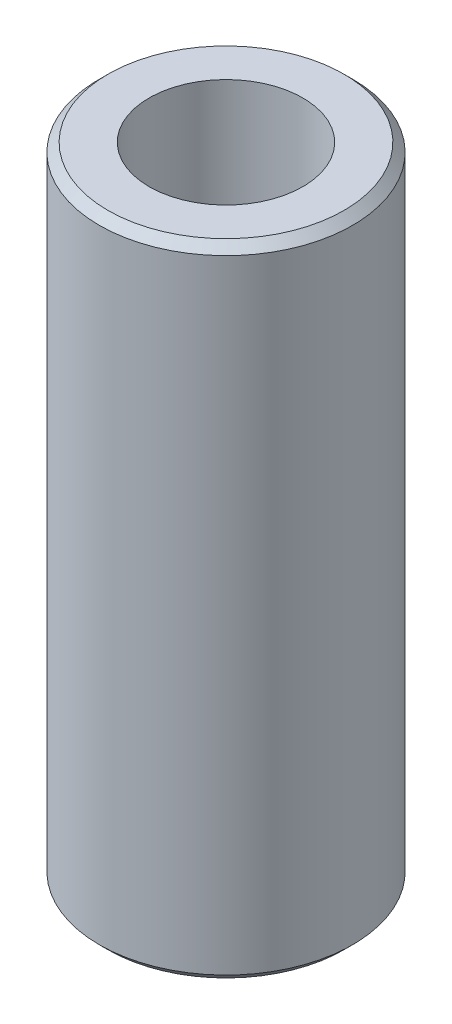
ISO-10303-21;
HEADER;
FILE_DESCRIPTION(('STEP AP214'),'2;1');
FILE_NAME('part.step','',(''),(''),'','','');
FILE_SCHEMA(('AUTOMOTIVE_DESIGN { 1 0 10303 214 1 1 1 1 }'));
ENDSEC;
DATA;
#1=APPLICATION_CONTEXT('core data for automotive mechanical design processes');
#2=APPLICATION_PROTOCOL_DEFINITION('international standard','automotive_design',2000,#1);
#3=PRODUCT_CONTEXT('',#1,'mechanical');
#4=PRODUCT('Part','Part','',(#3));
#5=PRODUCT_RELATED_PRODUCT_CATEGORY('part','',(#4));
#6=PRODUCT_DEFINITION_FORMATION('','',#4);
#7=PRODUCT_DEFINITION_CONTEXT('part definition',#1,'design');
#8=PRODUCT_DEFINITION('design','',#6,#7);
#9=PRODUCT_DEFINITION_SHAPE('','',#8);
#10=(LENGTH_UNIT() NAMED_UNIT(*) SI_UNIT(.MILLI.,.METRE.));
#11=(NAMED_UNIT(*) PLANE_ANGLE_UNIT() SI_UNIT($,.RADIAN.));
#12=(NAMED_UNIT(*) SI_UNIT($,.STERADIAN.) SOLID_ANGLE_UNIT());
#13=UNCERTAINTY_MEASURE_WITH_UNIT(LENGTH_MEASURE(1.E-05),#10,'distance_accuracy_value','');
#14=(GEOMETRIC_REPRESENTATION_CONTEXT(3) GLOBAL_UNCERTAINTY_ASSIGNED_CONTEXT((#13)) GLOBAL_UNIT_ASSIGNED_CONTEXT((#10,
#11,#12)) REPRESENTATION_CONTEXT('',''));
#15=CARTESIAN_POINT('',(0.,0.,0.));
#16=DIRECTION('',(0.,0.,1.));
#17=DIRECTION('',(1.,0.,0.));
#18=AXIS2_PLACEMENT_3D('',#15,#16,#17);
#19=CARTESIAN_POINT('',(0.,290.682610444791,0.));
#20=DIRECTION('',(0.,-1.,0.));
#21=DIRECTION('',(0.,0.,-1.));
#22=AXIS2_PLACEMENT_3D('',#19,#20,#21);
#23=CYLINDRICAL_SURFACE('',#22,57.5);
#24=CARTESIAN_POINT('',(0.,286.769581008649,0.));
#25=DIRECTION('',(0.,1.,0.));
#26=DIRECTION('',(0.,0.,1.));
#27=AXIS2_PLACEMENT_3D('',#24,#25,#26);
#28=CIRCLE('',#27,57.5);
#29=CARTESIAN_POINT('',(0.,286.769581008649,57.5));
#30=VERTEX_POINT('',#29);
#31=EDGE_CURVE('E50',#30,#30,#28,.F.);
#32=ORIENTED_EDGE('',*,*,#31,.T.);
#33=EDGE_LOOP('',(#32));
#34=FACE_BOUND('',#33,.T.);
#35=CARTESIAN_POINT('',(0.,3.91302943614164,0.));
#36=DIRECTION('',(0.,1.,0.));
#37=DIRECTION('',(0.,0.,1.));
#38=AXIS2_PLACEMENT_3D('',#35,#36,#37);
#39=CIRCLE('',#38,57.5);
#40=CARTESIAN_POINT('',(0.,3.91302943614164,57.5));
#41=VERTEX_POINT('',#40);
#42=EDGE_CURVE('E51',#41,#41,#39,.T.);
#43=ORIENTED_EDGE('',*,*,#42,.T.);
#44=EDGE_LOOP('',(#43));
#45=FACE_BOUND('',#44,.T.);
#46=ADVANCED_FACE('F39',(#34,#45),#23,.T.);
#47=CARTESIAN_POINT('',(0.,290.682610444791,0.));
#48=DIRECTION('',(0.,1.,0.));
#49=DIRECTION('',(0.,0.,1.));
#50=AXIS2_PLACEMENT_3D('',#47,#48,#49);
#51=PLANE('',#50);
#52=CARTESIAN_POINT('',(0.,290.682610444791,0.));
#53=DIRECTION('',(0.,1.,0.));
#54=DIRECTION('',(0.,0.,1.));
#55=AXIS2_PLACEMENT_3D('',#52,#53,#54);
#56=CIRCLE('',#55,53.5869705638584);
#57=CARTESIAN_POINT('',(0.,290.682610444791,53.5869705638584));
#58=VERTEX_POINT('',#57);
#59=EDGE_CURVE('E54',#58,#58,#56,.T.);
#60=ORIENTED_EDGE('',*,*,#59,.T.);
#61=EDGE_LOOP('',(#60));
#62=FACE_BOUND('',#61,.T.);
#63=CARTESIAN_POINT('',(0.,290.682610444791,0.));
#64=DIRECTION('',(0.,1.,0.));
#65=DIRECTION('',(0.,0.,1.));
#66=AXIS2_PLACEMENT_3D('',#63,#64,#65);
#67=CIRCLE('',#66,34.910680535032);
#68=CARTESIAN_POINT('',(0.,290.682610444791,34.910680535032));
#69=VERTEX_POINT('',#68);
#70=EDGE_CURVE('E58',#69,#69,#67,.T.);
#71=ORIENTED_EDGE('',*,*,#70,.F.);
#72=EDGE_LOOP('',(#71));
#73=FACE_BOUND('',#72,.T.);
#74=ADVANCED_FACE('F69',(#62,#73),#51,.T.);
#75=CARTESIAN_POINT('',(0.,0.,0.));
#76=DIRECTION('',(0.,1.,0.));
#77=DIRECTION('',(0.,0.,1.));
#78=AXIS2_PLACEMENT_3D('',#75,#76,#77);
#79=PLANE('',#78);
#80=CARTESIAN_POINT('',(0.,0.,0.));
#81=DIRECTION('',(0.,1.,0.));
#82=DIRECTION('',(0.,0.,1.));
#83=AXIS2_PLACEMENT_3D('',#80,#81,#82);
#84=CIRCLE('',#83,53.5869705638583);
#85=CARTESIAN_POINT('',(0.,0.,53.5869705638583));
#86=VERTEX_POINT('',#85);
#87=EDGE_CURVE('E10',#86,#86,#84,.F.);
#88=ORIENTED_EDGE('',*,*,#87,.T.);
#89=EDGE_LOOP('',(#88));
#90=FACE_BOUND('',#89,.T.);
#91=CARTESIAN_POINT('',(0.,0.,0.));
#92=DIRECTION('',(0.,1.,0.));
#93=DIRECTION('',(0.,0.,1.));
#94=AXIS2_PLACEMENT_3D('',#91,#92,#93);
#95=CIRCLE('',#94,34.910680535032);
#96=CARTESIAN_POINT('',(0.,0.,34.910680535032));
#97=VERTEX_POINT('',#96);
#98=EDGE_CURVE('E63',#97,#97,#95,.T.);
#99=ORIENTED_EDGE('',*,*,#98,.T.);
#100=EDGE_LOOP('',(#99));
#101=FACE_BOUND('',#100,.T.);
#102=ADVANCED_FACE('F75',(#90,#101),#79,.F.);
#103=CARTESIAN_POINT('',(0.,290.682610444791,0.));
#104=DIRECTION('',(0.,-1.,0.));
#105=DIRECTION('',(0.,0.,-1.));
#106=AXIS2_PLACEMENT_3D('',#103,#104,#105);
#107=CYLINDRICAL_SURFACE('',#106,34.910680535032);
#108=ORIENTED_EDGE('',*,*,#70,.T.);
#109=EDGE_LOOP('',(#108));
#110=FACE_BOUND('',#109,.T.);
#111=ORIENTED_EDGE('',*,*,#98,.F.);
#112=EDGE_LOOP('',(#111));
#113=FACE_BOUND('',#112,.T.);
#114=ADVANCED_FACE('F70',(#110,#113),#107,.F.);
#115=CARTESIAN_POINT('',(0.,290.682610444791,0.));
#116=DIRECTION('',(0.,-1.,0.));
#117=DIRECTION('',(0.,0.,-1.));
#118=AXIS2_PLACEMENT_3D('',#115,#116,#117);
#119=CONICAL_SURFACE('',#118,53.5869705638584,0.785398163397442);
#120=ORIENTED_EDGE('',*,*,#31,.F.);
#121=EDGE_LOOP('',(#120));
#122=FACE_BOUND('',#121,.T.);
#123=ORIENTED_EDGE('',*,*,#59,.F.);
#124=EDGE_LOOP('',(#123));
#125=FACE_BOUND('',#124,.T.);
#126=ADVANCED_FACE('F81',(#122,#125),#119,.T.);
#127=CARTESIAN_POINT('',(0.,3.91302943614164,0.));
#128=DIRECTION('',(0.,1.,0.));
#129=DIRECTION('',(0.,0.,1.));
#130=AXIS2_PLACEMENT_3D('',#127,#128,#129);
#131=CONICAL_SURFACE('',#130,57.5,0.785398163397452);
#132=ORIENTED_EDGE('',*,*,#87,.F.);
#133=EDGE_LOOP('',(#132));
#134=FACE_BOUND('',#133,.T.);
#135=ORIENTED_EDGE('',*,*,#42,.F.);
#136=EDGE_LOOP('',(#135));
#137=FACE_BOUND('',#136,.T.);
#138=ADVANCED_FACE('F45',(#134,#137),#131,.T.);
#139=CLOSED_SHELL('',(#46,#74,#102,#114,#126,#138));
#140=MANIFOLD_SOLID_BREP('B2',#139);
#141=ADVANCED_BREP_SHAPE_REPRESENTATION('',(#18,#140),#14);
#142=SHAPE_DEFINITION_REPRESENTATION(#9,#141);
ENDSEC;
END-ISO-10303-21;
